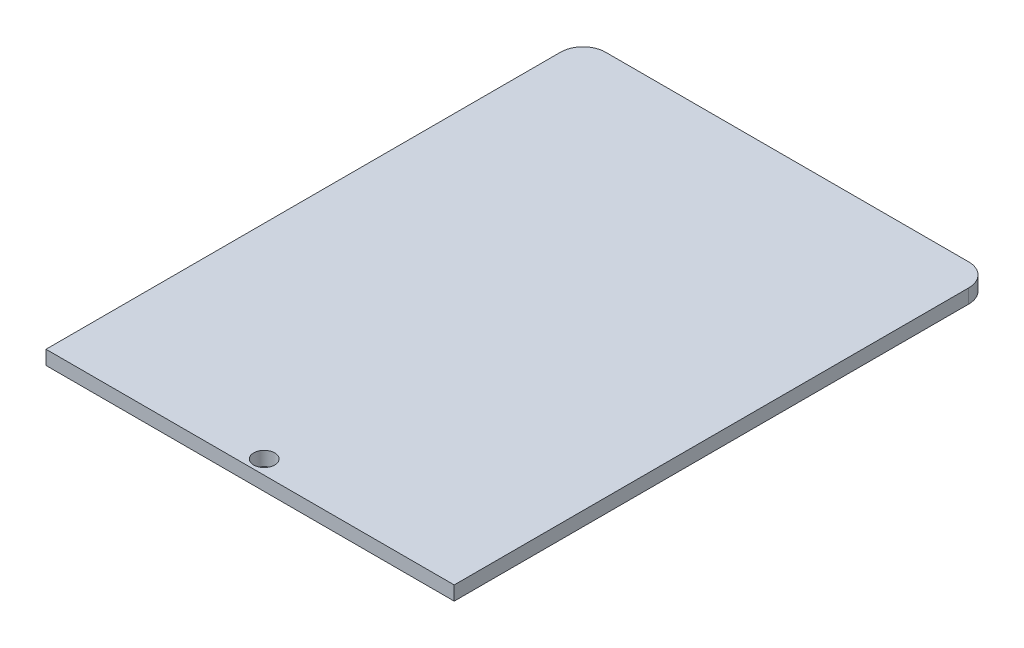
ISO-10303-21;
HEADER;
FILE_DESCRIPTION(('STEP AP214'),'2;1');
FILE_NAME('part.step','',(''),(''),'','','');
FILE_SCHEMA(('AUTOMOTIVE_DESIGN { 1 0 10303 214 1 1 1 1 }'));
ENDSEC;
DATA;
#1=APPLICATION_CONTEXT('core data for automotive mechanical design processes');
#2=APPLICATION_PROTOCOL_DEFINITION('international standard','automotive_design',2000,#1);
#3=PRODUCT_CONTEXT('',#1,'mechanical');
#4=PRODUCT('Part','Part','',(#3));
#5=PRODUCT_RELATED_PRODUCT_CATEGORY('part','',(#4));
#6=PRODUCT_DEFINITION_FORMATION('','',#4);
#7=PRODUCT_DEFINITION_CONTEXT('part definition',#1,'design');
#8=PRODUCT_DEFINITION('design','',#6,#7);
#9=PRODUCT_DEFINITION_SHAPE('','',#8);
#10=(LENGTH_UNIT() NAMED_UNIT(*) SI_UNIT(.MILLI.,.METRE.));
#11=(NAMED_UNIT(*) PLANE_ANGLE_UNIT() SI_UNIT($,.RADIAN.));
#12=(NAMED_UNIT(*) SI_UNIT($,.STERADIAN.) SOLID_ANGLE_UNIT());
#13=UNCERTAINTY_MEASURE_WITH_UNIT(LENGTH_MEASURE(1.E-05),#10,'distance_accuracy_value','');
#14=(GEOMETRIC_REPRESENTATION_CONTEXT(3) GLOBAL_UNCERTAINTY_ASSIGNED_CONTEXT((#13)) GLOBAL_UNIT_ASSIGNED_CONTEXT((#10,
#11,#12)) REPRESENTATION_CONTEXT('',''));
#15=CARTESIAN_POINT('',(0.,0.,0.));
#16=DIRECTION('',(0.,0.,1.));
#17=DIRECTION('',(1.,0.,0.));
#18=AXIS2_PLACEMENT_3D('',#15,#16,#17);
#19=CARTESIAN_POINT('',(2.54,1.5875,-58.039));
#20=DIRECTION('',(0.,1.,0.));
#21=DIRECTION('',(0.,0.,1.));
#22=AXIS2_PLACEMENT_3D('',#19,#20,#21);
#23=PLANE('',#22);
#24=DIRECTION('',(0.,0.,-1.));
#25=VECTOR('',#24,1.);
#26=CARTESIAN_POINT('',(46.0462561601996,1.5875,-58.039));
#27=LINE('',#26,#25);
#28=CARTESIAN_POINT('',(46.0462561601996,1.5875,0.));
#29=VERTEX_POINT('',#28);
#30=CARTESIAN_POINT('',(46.0462561601996,1.5875,-58.039));
#31=VERTEX_POINT('',#30);
#32=EDGE_CURVE('E150',#29,#31,#27,.T.);
#33=ORIENTED_EDGE('',*,*,#32,.T.);
#34=CARTESIAN_POINT('',(43.5062561601996,1.5875,-58.039));
#35=DIRECTION('',(0.,1.,0.));
#36=DIRECTION('',(0.,0.,1.));
#37=AXIS2_PLACEMENT_3D('',#34,#35,#36);
#38=CIRCLE('',#37,2.54);
#39=CARTESIAN_POINT('',(43.5062561601996,1.5875,-60.579));
#40=VERTEX_POINT('',#39);
#41=EDGE_CURVE('E98',#31,#40,#38,.T.);
#42=ORIENTED_EDGE('',*,*,#41,.T.);
#43=DIRECTION('',(-1.,0.,0.));
#44=VECTOR('',#43,1.);
#45=CARTESIAN_POINT('',(2.54000000000002,1.5875,-60.579));
#46=LINE('',#45,#44);
#47=CARTESIAN_POINT('',(2.54000000000002,1.5875,-60.579));
#48=VERTEX_POINT('',#47);
#49=EDGE_CURVE('E111',#40,#48,#46,.T.);
#50=ORIENTED_EDGE('',*,*,#49,.T.);
#51=CARTESIAN_POINT('',(2.54,1.5875,-58.039));
#52=DIRECTION('',(0.,1.,0.));
#53=DIRECTION('',(0.,0.,1.));
#54=AXIS2_PLACEMENT_3D('',#51,#52,#53);
#55=CIRCLE('',#54,2.54);
#56=CARTESIAN_POINT('',(0.,1.5875,-58.039));
#57=VERTEX_POINT('',#56);
#58=EDGE_CURVE('E105',#48,#57,#55,.T.);
#59=ORIENTED_EDGE('',*,*,#58,.T.);
#60=DIRECTION('',(0.,0.,1.));
#61=VECTOR('',#60,1.);
#62=CARTESIAN_POINT('',(0.,1.5875,-58.039));
#63=LINE('',#62,#61);
#64=CARTESIAN_POINT('',(0.,1.5875,0.));
#65=VERTEX_POINT('',#64);
#66=EDGE_CURVE('E109',#57,#65,#63,.T.);
#67=ORIENTED_EDGE('',*,*,#66,.T.);
#68=DIRECTION('',(1.,0.,0.));
#69=VECTOR('',#68,1.);
#70=CARTESIAN_POINT('',(0.,1.5875,0.));
#71=LINE('',#70,#69);
#72=EDGE_CURVE('E61',#65,#29,#71,.T.);
#73=ORIENTED_EDGE('',*,*,#72,.T.);
#74=EDGE_LOOP('',(#33,#42,#50,#59,#67,#73));
#75=FACE_BOUND('',#74,.T.);
#76=CARTESIAN_POINT('',(23.0231280800998,1.5875,-1.58750000000001));
#77=DIRECTION('',(0.,1.,0.));
#78=DIRECTION('',(0.,0.,1.));
#79=AXIS2_PLACEMENT_3D('',#76,#77,#78);
#80=CIRCLE('',#79,1.190625);
#81=CARTESIAN_POINT('',(23.0231280800998,1.5875,-0.396875000000006));
#82=VERTEX_POINT('',#81);
#83=EDGE_CURVE('E138',#82,#82,#80,.T.);
#84=ORIENTED_EDGE('',*,*,#83,.F.);
#85=EDGE_LOOP('',(#84));
#86=FACE_BOUND('',#85,.T.);
#87=ADVANCED_FACE('F43',(#75,#86),#23,.T.);
#88=CARTESIAN_POINT('',(2.54,0.,-58.039));
#89=DIRECTION('',(0.,1.,0.));
#90=DIRECTION('',(0.,0.,1.));
#91=AXIS2_PLACEMENT_3D('',#88,#89,#90);
#92=PLANE('',#91);
#93=DIRECTION('',(0.,0.,-1.));
#94=VECTOR('',#93,1.);
#95=CARTESIAN_POINT('',(46.0462561601996,0.,-58.039));
#96=LINE('',#95,#94);
#97=CARTESIAN_POINT('',(46.0462561601996,0.,0.));
#98=VERTEX_POINT('',#97);
#99=CARTESIAN_POINT('',(46.0462561601996,0.,-58.039));
#100=VERTEX_POINT('',#99);
#101=EDGE_CURVE('E133',#98,#100,#96,.T.);
#102=ORIENTED_EDGE('',*,*,#101,.F.);
#103=DIRECTION('',(1.,0.,0.));
#104=VECTOR('',#103,1.);
#105=CARTESIAN_POINT('',(0.,0.,0.));
#106=LINE('',#105,#104);
#107=CARTESIAN_POINT('',(0.,0.,0.));
#108=VERTEX_POINT('',#107);
#109=EDGE_CURVE('E90',#108,#98,#106,.T.);
#110=ORIENTED_EDGE('',*,*,#109,.F.);
#111=DIRECTION('',(0.,0.,1.));
#112=VECTOR('',#111,1.);
#113=CARTESIAN_POINT('',(0.,0.,-58.039));
#114=LINE('',#113,#112);
#115=CARTESIAN_POINT('',(0.,0.,-58.039));
#116=VERTEX_POINT('',#115);
#117=EDGE_CURVE('E84',#116,#108,#114,.T.);
#118=ORIENTED_EDGE('',*,*,#117,.F.);
#119=CARTESIAN_POINT('',(2.54,0.,-58.039));
#120=DIRECTION('',(0.,1.,0.));
#121=DIRECTION('',(0.,0.,1.));
#122=AXIS2_PLACEMENT_3D('',#119,#120,#121);
#123=CIRCLE('',#122,2.54);
#124=CARTESIAN_POINT('',(2.54000000000002,0.,-60.579));
#125=VERTEX_POINT('',#124);
#126=EDGE_CURVE('E120',#125,#116,#123,.T.);
#127=ORIENTED_EDGE('',*,*,#126,.F.);
#128=DIRECTION('',(-1.,0.,0.));
#129=VECTOR('',#128,1.);
#130=CARTESIAN_POINT('',(2.54000000000002,0.,-60.579));
#131=LINE('',#130,#129);
#132=CARTESIAN_POINT('',(43.5062561601996,0.,-60.579));
#133=VERTEX_POINT('',#132);
#134=EDGE_CURVE('E141',#133,#125,#131,.T.);
#135=ORIENTED_EDGE('',*,*,#134,.F.);
#136=CARTESIAN_POINT('',(43.5062561601996,0.,-58.039));
#137=DIRECTION('',(0.,1.,0.));
#138=DIRECTION('',(0.,0.,1.));
#139=AXIS2_PLACEMENT_3D('',#136,#137,#138);
#140=CIRCLE('',#139,2.54);
#141=EDGE_CURVE('E137',#100,#133,#140,.T.);
#142=ORIENTED_EDGE('',*,*,#141,.F.);
#143=EDGE_LOOP('',(#102,#110,#118,#127,#135,#142));
#144=FACE_BOUND('',#143,.T.);
#145=CARTESIAN_POINT('',(23.0231280800998,0.,-1.58750000000001));
#146=DIRECTION('',(0.,1.,0.));
#147=DIRECTION('',(0.,0.,1.));
#148=AXIS2_PLACEMENT_3D('',#145,#146,#147);
#149=CIRCLE('',#148,1.190625);
#150=CARTESIAN_POINT('',(23.0231280800998,0.,-0.396875000000006));
#151=VERTEX_POINT('',#150);
#152=EDGE_CURVE('E265',#151,#151,#149,.T.);
#153=ORIENTED_EDGE('',*,*,#152,.T.);
#154=EDGE_LOOP('',(#153));
#155=FACE_BOUND('',#154,.T.);
#156=ADVANCED_FACE('F163',(#144,#155),#92,.F.);
#157=CARTESIAN_POINT('',(46.0462561601996,1.5875,-58.039));
#158=DIRECTION('',(-1.,0.,0.));
#159=DIRECTION('',(0.,0.,1.));
#160=AXIS2_PLACEMENT_3D('',#157,#158,#159);
#161=PLANE('',#160);
#162=ORIENTED_EDGE('',*,*,#101,.T.);
#163=DIRECTION('',(0.,-1.,0.));
#164=VECTOR('',#163,1.);
#165=CARTESIAN_POINT('',(46.0462561601996,1.5875,-58.039));
#166=LINE('',#165,#164);
#167=EDGE_CURVE('E11',#31,#100,#166,.T.);
#168=ORIENTED_EDGE('',*,*,#167,.F.);
#169=ORIENTED_EDGE('',*,*,#32,.F.);
#170=DIRECTION('',(0.,-1.,0.));
#171=VECTOR('',#170,1.);
#172=CARTESIAN_POINT('',(46.0462561601996,1.5875,0.));
#173=LINE('',#172,#171);
#174=EDGE_CURVE('E129',#29,#98,#173,.T.);
#175=ORIENTED_EDGE('',*,*,#174,.T.);
#176=EDGE_LOOP('',(#162,#168,#169,#175));
#177=FACE_BOUND('',#176,.T.);
#178=ADVANCED_FACE('F45',(#177),#161,.F.);
#179=CARTESIAN_POINT('',(43.5062561601996,1.5875,-58.039));
#180=DIRECTION('',(0.,-1.,0.));
#181=DIRECTION('',(0.,0.,-1.));
#182=AXIS2_PLACEMENT_3D('',#179,#180,#181);
#183=CYLINDRICAL_SURFACE('',#182,2.54);
#184=ORIENTED_EDGE('',*,*,#141,.T.);
#185=DIRECTION('',(0.,-1.,0.));
#186=VECTOR('',#185,1.);
#187=CARTESIAN_POINT('',(43.5062561601996,1.5875,-60.579));
#188=LINE('',#187,#186);
#189=EDGE_CURVE('E53',#40,#133,#188,.T.);
#190=ORIENTED_EDGE('',*,*,#189,.F.);
#191=ORIENTED_EDGE('',*,*,#41,.F.);
#192=ORIENTED_EDGE('',*,*,#167,.T.);
#193=EDGE_LOOP('',(#184,#190,#191,#192));
#194=FACE_BOUND('',#193,.T.);
#195=ADVANCED_FACE('F188',(#194),#183,.T.);
#196=CARTESIAN_POINT('',(2.54000000000002,1.5875,-60.579));
#197=DIRECTION('',(0.,0.,1.));
#198=DIRECTION('',(1.,0.,0.));
#199=AXIS2_PLACEMENT_3D('',#196,#197,#198);
#200=PLANE('',#199);
#201=ORIENTED_EDGE('',*,*,#134,.T.);
#202=DIRECTION('',(0.,-1.,0.));
#203=VECTOR('',#202,1.);
#204=CARTESIAN_POINT('',(2.54000000000002,1.5875,-60.579));
#205=LINE('',#204,#203);
#206=EDGE_CURVE('E122',#48,#125,#205,.T.);
#207=ORIENTED_EDGE('',*,*,#206,.F.);
#208=ORIENTED_EDGE('',*,*,#49,.F.);
#209=ORIENTED_EDGE('',*,*,#189,.T.);
#210=EDGE_LOOP('',(#201,#207,#208,#209));
#211=FACE_BOUND('',#210,.T.);
#212=ADVANCED_FACE('F160',(#211),#200,.F.);
#213=CARTESIAN_POINT('',(2.54,1.5875,-58.039));
#214=DIRECTION('',(0.,-1.,0.));
#215=DIRECTION('',(0.,0.,-1.));
#216=AXIS2_PLACEMENT_3D('',#213,#214,#215);
#217=CYLINDRICAL_SURFACE('',#216,2.54);
#218=ORIENTED_EDGE('',*,*,#126,.T.);
#219=DIRECTION('',(0.,-1.,0.));
#220=VECTOR('',#219,1.);
#221=CARTESIAN_POINT('',(0.,1.5875,-58.039));
#222=LINE('',#221,#220);
#223=EDGE_CURVE('E117',#57,#116,#222,.T.);
#224=ORIENTED_EDGE('',*,*,#223,.F.);
#225=ORIENTED_EDGE('',*,*,#58,.F.);
#226=ORIENTED_EDGE('',*,*,#206,.T.);
#227=EDGE_LOOP('',(#218,#224,#225,#226));
#228=FACE_BOUND('',#227,.T.);
#229=ADVANCED_FACE('F118',(#228),#217,.T.);
#230=CARTESIAN_POINT('',(0.,1.5875,-58.039));
#231=DIRECTION('',(1.,0.,0.));
#232=DIRECTION('',(0.,0.,-1.));
#233=AXIS2_PLACEMENT_3D('',#230,#231,#232);
#234=PLANE('',#233);
#235=ORIENTED_EDGE('',*,*,#117,.T.);
#236=DIRECTION('',(0.,-1.,0.));
#237=VECTOR('',#236,1.);
#238=CARTESIAN_POINT('',(0.,1.5875,0.));
#239=LINE('',#238,#237);
#240=EDGE_CURVE('E123',#65,#108,#239,.T.);
#241=ORIENTED_EDGE('',*,*,#240,.F.);
#242=ORIENTED_EDGE('',*,*,#66,.F.);
#243=ORIENTED_EDGE('',*,*,#223,.T.);
#244=EDGE_LOOP('',(#235,#241,#242,#243));
#245=FACE_BOUND('',#244,.T.);
#246=ADVANCED_FACE('F125',(#245),#234,.F.);
#247=CARTESIAN_POINT('',(0.,1.5875,0.));
#248=DIRECTION('',(0.,0.,-1.));
#249=DIRECTION('',(-1.,0.,0.));
#250=AXIS2_PLACEMENT_3D('',#247,#248,#249);
#251=PLANE('',#250);
#252=ORIENTED_EDGE('',*,*,#109,.T.);
#253=ORIENTED_EDGE('',*,*,#174,.F.);
#254=ORIENTED_EDGE('',*,*,#72,.F.);
#255=ORIENTED_EDGE('',*,*,#240,.T.);
#256=EDGE_LOOP('',(#252,#253,#254,#255));
#257=FACE_BOUND('',#256,.T.);
#258=ADVANCED_FACE('F168',(#257),#251,.F.);
#259=CARTESIAN_POINT('',(23.0231280800998,1.5875,-1.58750000000001));
#260=DIRECTION('',(0.,-1.,0.));
#261=DIRECTION('',(0.,0.,-1.));
#262=AXIS2_PLACEMENT_3D('',#259,#260,#261);
#263=CYLINDRICAL_SURFACE('',#262,1.190625);
#264=ORIENTED_EDGE('',*,*,#83,.T.);
#265=EDGE_LOOP('',(#264));
#266=FACE_BOUND('',#265,.T.);
#267=ORIENTED_EDGE('',*,*,#152,.F.);
#268=EDGE_LOOP('',(#267));
#269=FACE_BOUND('',#268,.T.);
#270=ADVANCED_FACE('F170',(#266,#269),#263,.F.);
#271=CLOSED_SHELL('',(#87,#156,#178,#195,#212,#229,#246,#258,#270));
#272=MANIFOLD_SOLID_BREP('B2',#271);
#273=ADVANCED_BREP_SHAPE_REPRESENTATION('',(#18,#272),#14);
#274=SHAPE_DEFINITION_REPRESENTATION(#9,#273);
ENDSEC;
END-ISO-10303-21;
